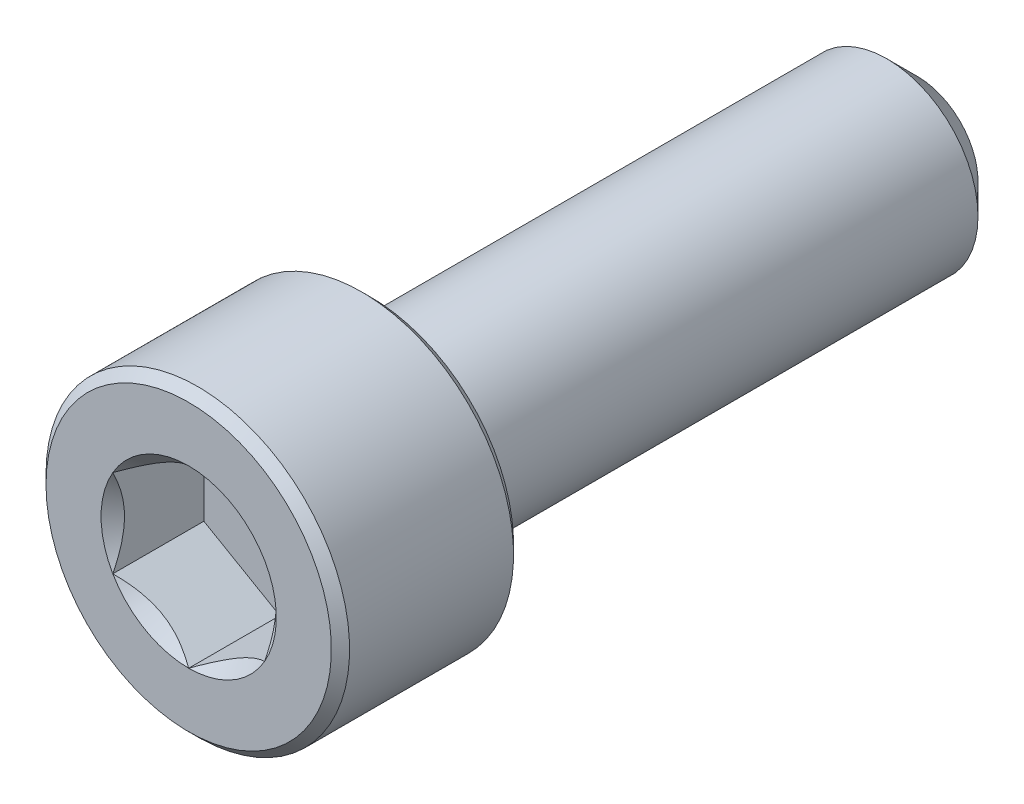
ISO-10303-21;
HEADER;
FILE_DESCRIPTION(('STEP AP214'),'2;1');
FILE_NAME('part.step','',(''),(''),'','','');
FILE_SCHEMA(('AUTOMOTIVE_DESIGN { 1 0 10303 214 1 1 1 1 }'));
ENDSEC;
DATA;
#1=APPLICATION_CONTEXT('core data for automotive mechanical design processes');
#2=APPLICATION_PROTOCOL_DEFINITION('international standard','automotive_design',2000,#1);
#3=PRODUCT_CONTEXT('',#1,'mechanical');
#4=PRODUCT('Part','Part','',(#3));
#5=PRODUCT_RELATED_PRODUCT_CATEGORY('part','',(#4));
#6=PRODUCT_DEFINITION_FORMATION('','',#4);
#7=PRODUCT_DEFINITION_CONTEXT('part definition',#1,'design');
#8=PRODUCT_DEFINITION('design','',#6,#7);
#9=PRODUCT_DEFINITION_SHAPE('','',#8);
#10=(LENGTH_UNIT() NAMED_UNIT(*) SI_UNIT(.MILLI.,.METRE.));
#11=(NAMED_UNIT(*) PLANE_ANGLE_UNIT() SI_UNIT($,.RADIAN.));
#12=(NAMED_UNIT(*) SI_UNIT($,.STERADIAN.) SOLID_ANGLE_UNIT());
#13=UNCERTAINTY_MEASURE_WITH_UNIT(LENGTH_MEASURE(1.E-05),#10,'distance_accuracy_value','');
#14=(GEOMETRIC_REPRESENTATION_CONTEXT(3) GLOBAL_UNCERTAINTY_ASSIGNED_CONTEXT((#13)) GLOBAL_UNIT_ASSIGNED_CONTEXT((#10,
#11,#12)) REPRESENTATION_CONTEXT('',''));
#15=CARTESIAN_POINT('',(0.,0.,0.));
#16=DIRECTION('',(0.,0.,1.));
#17=DIRECTION('',(1.,0.,0.));
#18=AXIS2_PLACEMENT_3D('',#15,#16,#17);
#19=CARTESIAN_POINT('',(0.,4.7,12.));
#20=DIRECTION('',(0.,0.,1.));
#21=DIRECTION('',(1.,0.,0.));
#22=AXIS2_PLACEMENT_3D('',#19,#20,#21);
#23=PLANE('',#22);
#24=CARTESIAN_POINT('',(0.,0.,12.));
#25=DIRECTION('',(0.,0.,1.));
#26=DIRECTION('',(1.,0.,0.));
#27=AXIS2_PLACEMENT_3D('',#24,#25,#26);
#28=CIRCLE('',#27,2.88675134594813);
#29=CARTESIAN_POINT('',(2.5,1.44337567297407,12.));
#30=VERTEX_POINT('',#29);
#31=CARTESIAN_POINT('',(0.,2.88675134594813,12.));
#32=VERTEX_POINT('',#31);
#33=EDGE_CURVE('E92',#30,#32,#28,.T.);
#34=ORIENTED_EDGE('',*,*,#33,.F.);
#35=CARTESIAN_POINT('',(2.5,-1.44337567297407,12.));
#36=VERTEX_POINT('',#35);
#37=EDGE_CURVE('E52',#36,#30,#28,.T.);
#38=ORIENTED_EDGE('',*,*,#37,.F.);
#39=CARTESIAN_POINT('',(0.,-2.88675134594813,12.));
#40=VERTEX_POINT('',#39);
#41=EDGE_CURVE('E278',#40,#36,#28,.T.);
#42=ORIENTED_EDGE('',*,*,#41,.F.);
#43=CARTESIAN_POINT('',(-2.5,-1.44337567297406,12.));
#44=VERTEX_POINT('',#43);
#45=EDGE_CURVE('E59',#44,#40,#28,.T.);
#46=ORIENTED_EDGE('',*,*,#45,.F.);
#47=CARTESIAN_POINT('',(-2.5,1.44337567297407,12.));
#48=VERTEX_POINT('',#47);
#49=EDGE_CURVE('E128',#48,#44,#28,.T.);
#50=ORIENTED_EDGE('',*,*,#49,.F.);
#51=EDGE_CURVE('E101',#32,#48,#28,.T.);
#52=ORIENTED_EDGE('',*,*,#51,.F.);
#53=EDGE_LOOP('',(#34,#38,#42,#46,#50,#52));
#54=FACE_BOUND('',#53,.T.);
#55=CARTESIAN_POINT('',(0.,0.,12.));
#56=DIRECTION('',(0.,0.,-1.));
#57=DIRECTION('',(-1.,0.,0.));
#58=AXIS2_PLACEMENT_3D('',#55,#56,#57);
#59=CIRCLE('',#58,4.7);
#60=CARTESIAN_POINT('',(-4.7,0.,12.));
#61=VERTEX_POINT('',#60);
#62=EDGE_CURVE('E46',#61,#61,#59,.T.);
#63=ORIENTED_EDGE('',*,*,#62,.F.);
#64=EDGE_LOOP('',(#63));
#65=FACE_BOUND('',#64,.T.);
#66=ADVANCED_FACE('F33',(#54,#65),#23,.T.);
#67=CARTESIAN_POINT('',(0.,0.,11.7));
#68=DIRECTION('',(0.,0.,-1.));
#69=DIRECTION('',(-1.,0.,0.));
#70=AXIS2_PLACEMENT_3D('',#67,#68,#69);
#71=CONICAL_SURFACE('',#70,5.,0.785398163397451);
#72=ORIENTED_EDGE('',*,*,#62,.T.);
#73=EDGE_LOOP('',(#72));
#74=FACE_BOUND('',#73,.T.);
#75=CARTESIAN_POINT('',(0.,0.,11.7));
#76=DIRECTION('',(0.,0.,-1.));
#77=DIRECTION('',(-1.,0.,0.));
#78=AXIS2_PLACEMENT_3D('',#75,#76,#77);
#79=CIRCLE('',#78,5.);
#80=CARTESIAN_POINT('',(-5.,0.,11.7));
#81=VERTEX_POINT('',#80);
#82=EDGE_CURVE('E212',#81,#81,#79,.T.);
#83=ORIENTED_EDGE('',*,*,#82,.F.);
#84=EDGE_LOOP('',(#83));
#85=FACE_BOUND('',#84,.T.);
#86=ADVANCED_FACE('F217',(#74,#85),#71,.T.);
#87=CARTESIAN_POINT('',(0.,0.,-12.));
#88=DIRECTION('',(0.,0.,-1.));
#89=DIRECTION('',(-1.,0.,0.));
#90=AXIS2_PLACEMENT_3D('',#87,#88,#89);
#91=CYLINDRICAL_SURFACE('',#90,5.);
#92=ORIENTED_EDGE('',*,*,#82,.T.);
#93=EDGE_LOOP('',(#92));
#94=FACE_BOUND('',#93,.T.);
#95=CARTESIAN_POINT('',(0.,0.,6.3));
#96=DIRECTION('',(0.,0.,-1.));
#97=DIRECTION('',(-1.,0.,0.));
#98=AXIS2_PLACEMENT_3D('',#95,#96,#97);
#99=CIRCLE('',#98,5.);
#100=CARTESIAN_POINT('',(-5.,0.,6.3));
#101=VERTEX_POINT('',#100);
#102=EDGE_CURVE('E209',#101,#101,#99,.T.);
#103=ORIENTED_EDGE('',*,*,#102,.F.);
#104=EDGE_LOOP('',(#103));
#105=FACE_BOUND('',#104,.T.);
#106=ADVANCED_FACE('F223',(#94,#105),#91,.T.);
#107=CARTESIAN_POINT('',(0.,0.,6.));
#108=DIRECTION('',(0.,0.,1.));
#109=DIRECTION('',(1.,0.,0.));
#110=AXIS2_PLACEMENT_3D('',#107,#108,#109);
#111=CONICAL_SURFACE('',#110,4.7,0.785398163397453);
#112=ORIENTED_EDGE('',*,*,#102,.T.);
#113=EDGE_LOOP('',(#112));
#114=FACE_BOUND('',#113,.T.);
#115=CARTESIAN_POINT('',(0.,0.,6.));
#116=DIRECTION('',(0.,0.,-1.));
#117=DIRECTION('',(-1.,0.,0.));
#118=AXIS2_PLACEMENT_3D('',#115,#116,#117);
#119=CIRCLE('',#118,4.7);
#120=CARTESIAN_POINT('',(-4.7,0.,6.));
#121=VERTEX_POINT('',#120);
#122=EDGE_CURVE('E206',#121,#121,#119,.T.);
#123=ORIENTED_EDGE('',*,*,#122,.F.);
#124=EDGE_LOOP('',(#123));
#125=FACE_BOUND('',#124,.T.);
#126=ADVANCED_FACE('F227',(#114,#125),#111,.T.);
#127=CARTESIAN_POINT('',(0.,4.7,6.));
#128=DIRECTION('',(0.,0.,-1.));
#129=DIRECTION('',(-1.,0.,0.));
#130=AXIS2_PLACEMENT_3D('',#127,#128,#129);
#131=PLANE('',#130);
#132=ORIENTED_EDGE('',*,*,#122,.T.);
#133=EDGE_LOOP('',(#132));
#134=FACE_BOUND('',#133,.T.);
#135=CARTESIAN_POINT('',(0.,0.,6.));
#136=DIRECTION('',(0.,0.,-1.));
#137=DIRECTION('',(-1.,0.,0.));
#138=AXIS2_PLACEMENT_3D('',#135,#136,#137);
#139=CIRCLE('',#138,3.);
#140=CARTESIAN_POINT('',(-3.,0.,6.));
#141=VERTEX_POINT('',#140);
#142=EDGE_CURVE('E203',#141,#141,#139,.T.);
#143=ORIENTED_EDGE('',*,*,#142,.F.);
#144=EDGE_LOOP('',(#143));
#145=FACE_BOUND('',#144,.T.);
#146=ADVANCED_FACE('F233',(#134,#145),#131,.T.);
#147=CARTESIAN_POINT('',(0.,0.,-12.));
#148=DIRECTION('',(0.,0.,-1.));
#149=DIRECTION('',(-1.,0.,0.));
#150=AXIS2_PLACEMENT_3D('',#147,#148,#149);
#151=CYLINDRICAL_SURFACE('',#150,3.);
#152=ORIENTED_EDGE('',*,*,#142,.T.);
#153=EDGE_LOOP('',(#152));
#154=FACE_BOUND('',#153,.T.);
#155=CARTESIAN_POINT('',(0.,0.,-11.));
#156=DIRECTION('',(0.,0.,-1.));
#157=DIRECTION('',(-1.,0.,0.));
#158=AXIS2_PLACEMENT_3D('',#155,#156,#157);
#159=CIRCLE('',#158,3.);
#160=CARTESIAN_POINT('',(-3.,0.,-11.));
#161=VERTEX_POINT('',#160);
#162=EDGE_CURVE('E200',#161,#161,#159,.T.);
#163=ORIENTED_EDGE('',*,*,#162,.F.);
#164=EDGE_LOOP('',(#163));
#165=FACE_BOUND('',#164,.T.);
#166=ADVANCED_FACE('F237',(#154,#165),#151,.T.);
#167=CARTESIAN_POINT('',(0.,0.,-12.));
#168=DIRECTION('',(0.,0.,1.));
#169=DIRECTION('',(1.,0.,0.));
#170=AXIS2_PLACEMENT_3D('',#167,#168,#169);
#171=CONICAL_SURFACE('',#170,2.,0.785398163397444);
#172=ORIENTED_EDGE('',*,*,#162,.T.);
#173=EDGE_LOOP('',(#172));
#174=FACE_BOUND('',#173,.T.);
#175=CARTESIAN_POINT('',(0.,0.,-12.));
#176=DIRECTION('',(0.,0.,-1.));
#177=DIRECTION('',(-1.,0.,0.));
#178=AXIS2_PLACEMENT_3D('',#175,#176,#177);
#179=CIRCLE('',#178,2.);
#180=CARTESIAN_POINT('',(-2.,0.,-12.));
#181=VERTEX_POINT('',#180);
#182=EDGE_CURVE('E188',#181,#181,#179,.T.);
#183=ORIENTED_EDGE('',*,*,#182,.F.);
#184=EDGE_LOOP('',(#183));
#185=FACE_BOUND('',#184,.T.);
#186=ADVANCED_FACE('F240',(#174,#185),#171,.T.);
#187=CARTESIAN_POINT('',(0.,2.,-12.));
#188=DIRECTION('',(0.,0.,-1.));
#189=DIRECTION('',(-1.,0.,0.));
#190=AXIS2_PLACEMENT_3D('',#187,#188,#189);
#191=PLANE('',#190);
#192=ORIENTED_EDGE('',*,*,#182,.T.);
#193=EDGE_LOOP('',(#192));
#194=FACE_BOUND('',#193,.T.);
#195=ADVANCED_FACE('F161',(#194),#191,.T.);
#196=CARTESIAN_POINT('',(0.,0.,12.));
#197=DIRECTION('',(0.,0.,1.));
#198=DIRECTION('',(1.,0.,0.));
#199=AXIS2_PLACEMENT_3D('',#196,#197,#198);
#200=CONICAL_SURFACE('',#199,2.88675134594813,0.78539816339745);
#201=ORIENTED_EDGE('',*,*,#51,.T.);
#202=CARTESIAN_POINT('',(0.00020000000000054,2.88686681600197,12.0001154769818));
#203=CARTESIAN_POINT('',(-0.0857382777877643,2.83725032818751,11.9505407053547));
#204=CARTESIAN_POINT('',(-0.173113567275753,2.7868041812811,11.9038774813625));
#205=CARTESIAN_POINT('',(-0.351281456165588,2.6839389026696,11.8184381400383));
#206=CARTESIAN_POINT('',(-0.442091000681074,2.6315099876986,11.779709562406));
#207=CARTESIAN_POINT('',(-0.625204123126921,2.52578957716234,11.7133667038977));
#208=CARTESIAN_POINT('',(-0.71746106452934,2.47252500720904,11.6855856685309));
#209=CARTESIAN_POINT('',(-0.904006008776286,2.3648232334321,11.6427831759107));
#210=CARTESIAN_POINT('',(-0.998288312566283,2.31038931995913,11.6277297666713));
#211=CARTESIAN_POINT('',(-1.16077825829185,2.21657570605387,11.6141477222095));
#212=CARTESIAN_POINT('',(-1.22877596788015,2.17731721011878,11.6121370992408));
#213=CARTESIAN_POINT('',(-1.36466024116922,2.0988643883567,11.6155241171875));
#214=CARTESIAN_POINT('',(-1.43254675755224,2.05967008984862,11.6209243552998));
#215=CARTESIAN_POINT('',(-1.56767878823611,1.98165157555715,11.6388257884025));
#216=CARTESIAN_POINT('',(-1.63492349975356,1.94282782326097,11.6513349270465));
#217=CARTESIAN_POINT('',(-1.7682501008182,1.86585167424616,11.6827675019557));
#218=CARTESIAN_POINT('',(-1.83433207909966,1.82769922629678,11.7016904464968));
#219=CARTESIAN_POINT('',(-2.00359634669126,1.72997445583858,11.7578673614082));
#220=CARTESIAN_POINT('',(-2.10572912222289,1.67100807039231,11.7993558315962));
#221=CARTESIAN_POINT('',(-2.25590641494051,1.58430317001562,11.8693940467231));
#222=CARTESIAN_POINT('',(-2.30539653988261,1.55573003305807,11.8940022521161));
#223=CARTESIAN_POINT('',(-2.40346006383885,1.49911303110426,11.9454618867152));
#224=CARTESIAN_POINT('',(-2.45203400349693,1.47106885396706,11.9723119387794));
#225=CARTESIAN_POINT('',(-2.5002,1.44326020292023,12.0001154769818));
#226=B_SPLINE_CURVE_WITH_KNOTS('',3,(#202,#203,#204,#205,#206,#207,#208,#209,#210,#211,#212,
#213,#214,#215,#216,#217,#218,#219,#220,#221,#222,#223,#224,#225),.UNSPECIFIED.,.F.,.F.,(4,2,2,
2,2,2,2,2,2,2,2,4),(0.,0.333012085133924,0.667964518301397,0.997597032043299,1.32639954393844,
1.56169424147169,1.79707142102083,2.03271213522171,2.26833478775651,2.64260240809533,
2.82922877818864,3.01574133749025),.UNSPECIFIED.);
#227=EDGE_CURVE('E11',#32,#48,#226,.T.);
#228=ORIENTED_EDGE('',*,*,#227,.F.);
#229=EDGE_LOOP('',(#201,#228));
#230=FACE_BOUND('',#229,.T.);
#231=ADVANCED_FACE('F105',(#230),#200,.F.);
#232=ORIENTED_EDGE('',*,*,#49,.T.);
#233=CARTESIAN_POINT('',(-2.5,-2.96668433955212,12.9928383192799));
#234=CARTESIAN_POINT('',(-2.5,-2.89483170967249,12.9379057089797));
#235=CARTESIAN_POINT('',(-2.5,-2.82258679707705,12.883478050823));
#236=CARTESIAN_POINT('',(-2.5,-2.67715393829105,12.7758617915343));
#237=CARTESIAN_POINT('',(-2.5,-2.60396576868743,12.7226734926472));
#238=CARTESIAN_POINT('',(-2.5,-2.45595268046653,12.6173865397426));
#239=CARTESIAN_POINT('',(-2.5,-2.38111948346966,12.5652994850005));
#240=CARTESIAN_POINT('',(-2.5,-2.23019896534479,12.4629812536341));
#241=CARTESIAN_POINT('',(-2.5,-2.15411173180743,12.4127499481792));
#242=CARTESIAN_POINT('',(-2.5,-1.99575761371829,12.311547152196));
#243=CARTESIAN_POINT('',(-2.5,-1.91339821044007,12.2607196975498));
#244=CARTESIAN_POINT('',(-2.5,-1.74677292530007,12.1622970160088));
#245=CARTESIAN_POINT('',(-2.5,-1.6625072948511,12.1147013661458));
#246=CARTESIAN_POINT('',(-2.5,-1.49202090628761,12.0237370895292));
#247=CARTESIAN_POINT('',(-2.5,-1.4058065139511,11.9803566253319));
#248=CARTESIAN_POINT('',(-2.5,-1.23096887512707,11.8988023964179));
#249=CARTESIAN_POINT('',(-2.5,-1.14234677306193,11.8606262082116));
#250=CARTESIAN_POINT('',(-2.5,-0.970857842618474,11.7940912240297));
#251=CARTESIAN_POINT('',(-2.5,-0.88821917035142,11.7651503854592));
#252=CARTESIAN_POINT('',(-2.5,-0.720875298126569,11.7138877367376));
#253=CARTESIAN_POINT('',(-2.5,-0.636169963529764,11.6915663590842));
#254=CARTESIAN_POINT('',(-2.5,-0.466650942448522,11.6551078210399));
#255=CARTESIAN_POINT('',(-2.5,-0.381869134653474,11.640824902214));
#256=CARTESIAN_POINT('',(-2.5,-0.21130174226405,11.6207346384147));
#257=CARTESIAN_POINT('',(-2.5,-0.125516356521813,11.6149256421311));
#258=CARTESIAN_POINT('',(-2.5,0.0426703656744087,11.6122567453414));
#259=CARTESIAN_POINT('',(-2.5,0.125066107632579,11.6150393831091));
#260=CARTESIAN_POINT('',(-2.5,0.289193381610074,11.6285896677016));
#261=CARTESIAN_POINT('',(-2.5,0.370924851074764,11.6393580579361));
#262=CARTESIAN_POINT('',(-2.5,0.534518605306861,11.668460488394));
#263=CARTESIAN_POINT('',(-2.5,0.616357066153054,11.6869264467587));
#264=CARTESIAN_POINT('',(-2.5,0.778230408567296,11.7304160931401));
#265=CARTESIAN_POINT('',(-2.5,0.85826540901519,11.7554393475341));
#266=CARTESIAN_POINT('',(-2.5,1.1064014205137,11.8425323271403));
#267=CARTESIAN_POINT('',(-2.5,1.27108970475709,11.9143583169891));
#268=CARTESIAN_POINT('',(-2.5,1.51211013995078,12.0341428940312));
#269=CARTESIAN_POINT('',(-2.5,1.59159684007468,12.0761721404265));
#270=CARTESIAN_POINT('',(-2.5,1.74876895904321,12.1634810506814));
#271=CARTESIAN_POINT('',(-2.5,1.82645469386738,12.2087601385578));
#272=CARTESIAN_POINT('',(-2.5,1.97643122124165,12.2996104452916));
#273=CARTESIAN_POINT('',(-2.5,2.04879877304287,12.3450563815238));
#274=CARTESIAN_POINT('',(-2.5,2.19229239644038,12.4378770245958));
#275=CARTESIAN_POINT('',(-2.5,2.2634183740633,12.4852518765365));
#276=CARTESIAN_POINT('',(-2.5,2.4040160675888,12.5811974908952));
#277=CARTESIAN_POINT('',(-2.5,2.473496495387,12.6297555399303));
#278=CARTESIAN_POINT('',(-2.5,2.61150521882323,12.7281681623755));
#279=CARTESIAN_POINT('',(-2.5,2.68003377150943,12.7780223748942));
#280=CARTESIAN_POINT('',(-2.5,2.74816343524431,12.8284070984273));
#281=B_SPLINE_CURVE_WITH_KNOTS('',3,(#233,#234,#235,#236,#237,#238,#239,#240,#241,#242,#243,
#244,#245,#246,#247,#248,#249,#250,#251,#252,#253,#254,#255,#256,#257,#258,#259,#260,#261,#262,
#263,#264,#265,#266,#267,#268,#269,#270,#271,#272,#273,#274,#275,#276,#277,#278,#279,#280),
.UNSPECIFIED.,.F.,.F.,(4,2,2,2,2,2,2,2,2,2,2,2,2,2,2,2,2,2,2,2,2,2,2,4),(0.,0.271341667855833,
0.542748830046722,0.816253709161615,1.08973956507594,1.38002315639178,1.67026868280412,
1.959674013636,2.24894411253435,2.51139576932094,2.77386457021756,3.0314066607157,
3.28889855737335,3.53582375183444,3.78277193594475,4.03413854269895,4.28548853120069,
4.82282938730674,5.09254998785807,5.36222290216636,5.61855395261544,5.87490432107987,
6.12918893681204,6.38340349453406),.UNSPECIFIED.);
#282=EDGE_CURVE('E100',#48,#44,#281,.F.);
#283=ORIENTED_EDGE('',*,*,#282,.F.);
#284=EDGE_LOOP('',(#232,#283));
#285=FACE_BOUND('',#284,.T.);
#286=ADVANCED_FACE('F255',(#285),#200,.F.);
#287=ORIENTED_EDGE('',*,*,#45,.T.);
#288=CARTESIAN_POINT('',(-2.5002,-1.44326020292023,12.0001154769818));
#289=CARTESIAN_POINT('',(-2.41426172221224,-1.49287669073469,11.9505407053547));
#290=CARTESIAN_POINT('',(-2.32688643272425,-1.5433228376411,11.9038774813625));
#291=CARTESIAN_POINT('',(-2.14871854383441,-1.64618811625259,11.8184381400383));
#292=CARTESIAN_POINT('',(-2.05790899931893,-1.69861703122359,11.779709562406));
#293=CARTESIAN_POINT('',(-1.87479587687308,-1.80433744175986,11.7133667038977));
#294=CARTESIAN_POINT('',(-1.78253893547066,-1.85760201171315,11.6855856685309));
#295=CARTESIAN_POINT('',(-1.59599399122372,-1.96530378549009,11.6427831759107));
#296=CARTESIAN_POINT('',(-1.50171168743372,-2.01973769896306,11.6277297666713));
#297=CARTESIAN_POINT('',(-1.33922174170816,-2.11355131286833,11.6141477222095));
#298=CARTESIAN_POINT('',(-1.27122403211985,-2.15280980880341,11.6121370992408));
#299=CARTESIAN_POINT('',(-1.13533975883078,-2.23126263056549,11.6155241171875));
#300=CARTESIAN_POINT('',(-1.06745324244776,-2.27045692907357,11.6209243552998));
#301=CARTESIAN_POINT('',(-0.932321211763896,-2.34847544336505,11.6388257884025));
#302=CARTESIAN_POINT('',(-0.865076500246441,-2.38729919566123,11.6513349270465));
#303=CARTESIAN_POINT('',(-0.731749899181803,-2.46427534467603,11.6827675019557));
#304=CARTESIAN_POINT('',(-0.665667920900345,-2.50242779262542,11.7016904464968));
#305=CARTESIAN_POINT('',(-0.496403653308737,-2.60015256308362,11.7578673614082));
#306=CARTESIAN_POINT('',(-0.394270877777109,-2.65911894852989,11.7993558315962));
#307=CARTESIAN_POINT('',(-0.244093585059492,-2.74582384890657,11.8693940467231));
#308=CARTESIAN_POINT('',(-0.194603460117392,-2.77439698586412,11.8940022521161));
#309=CARTESIAN_POINT('',(-0.096539936161154,-2.83101398781794,11.9454618867152));
#310=CARTESIAN_POINT('',(-0.0479659965030727,-2.85905816495513,11.9723119387794));
#311=CARTESIAN_POINT('',(0.000199999999999383,-2.88686681600197,12.0001154769818));
#312=B_SPLINE_CURVE_WITH_KNOTS('',3,(#288,#289,#290,#291,#292,#293,#294,#295,#296,#297,#298,
#299,#300,#301,#302,#303,#304,#305,#306,#307,#308,#309,#310,#311),.UNSPECIFIED.,.F.,.F.,(4,2,2,
2,2,2,2,2,2,2,2,4),(0.,0.333012085133924,0.667964518301397,0.997597032043299,1.32639954393844,
1.56169424147169,1.79707142102083,2.03271213522171,2.26833478775651,2.64260240809533,
2.82922877818864,3.01574133749025),.UNSPECIFIED.);
#313=EDGE_CURVE('E137',#44,#40,#312,.T.);
#314=ORIENTED_EDGE('',*,*,#313,.F.);
#315=EDGE_LOOP('',(#287,#314));
#316=FACE_BOUND('',#315,.T.);
#317=ADVANCED_FACE('F259',(#316),#200,.F.);
#318=ORIENTED_EDGE('',*,*,#41,.T.);
#319=CARTESIAN_POINT('',(-0.000200000000000439,-2.88686681600197,12.0001154769818));
#320=CARTESIAN_POINT('',(0.0857382777877646,-2.83725032818751,11.9505407053547));
#321=CARTESIAN_POINT('',(0.173113567275753,-2.7868041812811,11.9038774813625));
#322=CARTESIAN_POINT('',(0.351281456165588,-2.6839389026696,11.8184381400383));
#323=CARTESIAN_POINT('',(0.442091000681074,-2.6315099876986,11.779709562406));
#324=CARTESIAN_POINT('',(0.62520412312692,-2.52578957716234,11.7133667038977));
#325=CARTESIAN_POINT('',(0.717461064529339,-2.47252500720904,11.6855856685309));
#326=CARTESIAN_POINT('',(0.904006008776284,-2.3648232334321,11.6427831759107));
#327=CARTESIAN_POINT('',(0.998288312566282,-2.31038931995913,11.6277297666713));
#328=CARTESIAN_POINT('',(1.16077825829184,-2.21657570605387,11.6141477222095));
#329=CARTESIAN_POINT('',(1.22877596788015,-2.17731721011878,11.6121370992408));
#330=CARTESIAN_POINT('',(1.36466024116922,-2.0988643883567,11.6155241171875));
#331=CARTESIAN_POINT('',(1.43254675755224,-2.05967008984862,11.6209243552998));
#332=CARTESIAN_POINT('',(1.5676787882361,-1.98165157555715,11.6388257884025));
#333=CARTESIAN_POINT('',(1.63492349975356,-1.94282782326097,11.6513349270465));
#334=CARTESIAN_POINT('',(1.7682501008182,-1.86585167424616,11.6827675019557));
#335=CARTESIAN_POINT('',(1.83433207909966,-1.82769922629678,11.7016904464968));
#336=CARTESIAN_POINT('',(2.00359634669126,-1.72997445583858,11.7578673614082));
#337=CARTESIAN_POINT('',(2.10572912222289,-1.67100807039231,11.7993558315962));
#338=CARTESIAN_POINT('',(2.25590641494051,-1.58430317001562,11.8693940467231));
#339=CARTESIAN_POINT('',(2.30539653988261,-1.55573003305807,11.8940022521161));
#340=CARTESIAN_POINT('',(2.40346006383885,-1.49911303110426,11.9454618867152));
#341=CARTESIAN_POINT('',(2.45203400349693,-1.47106885396706,11.9723119387794));
#342=CARTESIAN_POINT('',(2.5002,-1.44326020292023,12.0001154769818));
#343=B_SPLINE_CURVE_WITH_KNOTS('',3,(#319,#320,#321,#322,#323,#324,#325,#326,#327,#328,#329,
#330,#331,#332,#333,#334,#335,#336,#337,#338,#339,#340,#341,#342),.UNSPECIFIED.,.F.,.F.,(4,2,2,
2,2,2,2,2,2,2,2,4),(0.,0.333012085133923,0.667964518301395,0.997597032043296,1.32639954393844,
1.56169424147168,1.79707142102083,2.0327121352217,2.2683347877565,2.64260240809533,
2.82922877818864,3.01574133749025),.UNSPECIFIED.);
#344=EDGE_CURVE('E280',#40,#36,#343,.T.);
#345=ORIENTED_EDGE('',*,*,#344,.F.);
#346=EDGE_LOOP('',(#318,#345));
#347=FACE_BOUND('',#346,.T.);
#348=ADVANCED_FACE('F268',(#347),#200,.F.);
#349=ORIENTED_EDGE('',*,*,#37,.T.);
#350=CARTESIAN_POINT('',(2.5,-2.96668433956992,12.9928383192935));
#351=CARTESIAN_POINT('',(2.5,-2.89483170968978,12.9379057089928));
#352=CARTESIAN_POINT('',(2.5,-2.82258679709383,12.8834780508356));
#353=CARTESIAN_POINT('',(2.5,-2.6771539383068,12.7758617915458));
#354=CARTESIAN_POINT('',(2.5,-2.60396576870266,12.7226734926582));
#355=CARTESIAN_POINT('',(2.5,-2.45595268048071,12.6173865397526));
#356=CARTESIAN_POINT('',(2.5,-2.38111948348332,12.5652994850099));
#357=CARTESIAN_POINT('',(2.5,-2.23019896535737,12.4629812536425));
#358=CARTESIAN_POINT('',(2.5,-2.15411173181947,12.4127499481871));
#359=CARTESIAN_POINT('',(2.5,-1.99575761372916,12.3115471522028));
#360=CARTESIAN_POINT('',(2.5,-1.91339821045031,12.260719697556));
#361=CARTESIAN_POINT('',(2.5,-1.74677292530903,12.1622970160139));
#362=CARTESIAN_POINT('',(2.5,-1.6625072948594,12.1147013661504));
#363=CARTESIAN_POINT('',(2.5,-1.49202090629459,12.0237370895328));
#364=CARTESIAN_POINT('',(2.5,-1.4058065139574,11.980356625335));
#365=CARTESIAN_POINT('',(2.5,-1.23096887513198,11.8988023964201));
#366=CARTESIAN_POINT('',(2.5,-1.14234677306614,11.8606262082134));
#367=CARTESIAN_POINT('',(2.5,-0.970857842622378,11.7940912240311));
#368=CARTESIAN_POINT('',(2.5,-0.888219170355766,11.7651503854607));
#369=CARTESIAN_POINT('',(2.5,-0.720875298131817,11.713887736739));
#370=CARTESIAN_POINT('',(2.5,-0.636169963535471,11.6915663590856));
#371=CARTESIAN_POINT('',(2.5,-0.466650942455131,11.6551078210411));
#372=CARTESIAN_POINT('',(2.5,-0.381869134660527,11.6408249022151));
#373=CARTESIAN_POINT('',(2.5,-0.211301742271978,11.6207346384154));
#374=CARTESIAN_POINT('',(2.5,-0.125516356530172,11.6149256421315));
#375=CARTESIAN_POINT('',(2.5,0.0426703656652954,11.6122567453413));
#376=CARTESIAN_POINT('',(2.5,0.125066107623141,11.6150393831087));
#377=CARTESIAN_POINT('',(2.5,0.289193381600021,11.6285896677004));
#378=CARTESIAN_POINT('',(2.5,0.370924851064421,11.6393580579346));
#379=CARTESIAN_POINT('',(2.5,0.534518605295947,11.6684604883917));
#380=CARTESIAN_POINT('',(2.5,0.616357066141858,11.686926446756));
#381=CARTESIAN_POINT('',(2.5,0.778230408555567,11.7304160931367));
#382=CARTESIAN_POINT('',(2.5,0.858265409003208,11.7554393475302));
#383=CARTESIAN_POINT('',(2.5,1.10640142049915,11.8425323271345));
#384=CARTESIAN_POINT('',(2.5,1.27108970474035,11.9143583169815));
#385=CARTESIAN_POINT('',(2.5,1.51211013993089,12.034142894021));
#386=CARTESIAN_POINT('',(2.5,1.59159684005377,12.0761721404153));
#387=CARTESIAN_POINT('',(2.5,1.74876895902027,12.1634810506683));
#388=CARTESIAN_POINT('',(2.5,1.82645469384344,12.2087601385437));
#389=CARTESIAN_POINT('',(2.5,1.97643122121589,12.2996104452756));
#390=CARTESIAN_POINT('',(2.5,2.0487987730163,12.345056381507));
#391=CARTESIAN_POINT('',(2.5,2.19229239641219,12.4378770245772));
#392=CARTESIAN_POINT('',(2.5,2.26341837403431,12.485251876517));
#393=CARTESIAN_POINT('',(2.5,2.40401606755821,12.581197490874));
#394=CARTESIAN_POINT('',(2.5,2.47349649535563,12.6297555399082));
#395=CARTESIAN_POINT('',(2.5,2.61150521879029,12.7281681623517));
#396=CARTESIAN_POINT('',(2.5,2.68003377147571,12.7780223748695));
#397=CARTESIAN_POINT('',(2.5,2.74816343520981,12.8284070984017));
#398=B_SPLINE_CURVE_WITH_KNOTS('',3,(#350,#351,#352,#353,#354,#355,#356,#357,#358,#359,#360,
#361,#362,#363,#364,#365,#366,#367,#368,#369,#370,#371,#372,#373,#374,#375,#376,#377,#378,#379,
#380,#381,#382,#383,#384,#385,#386,#387,#388,#389,#390,#391,#392,#393,#394,#395,#396,#397),
.UNSPECIFIED.,.F.,.F.,(4,2,2,2,2,2,2,2,2,2,2,2,2,2,2,2,2,2,2,2,2,2,2,4),(0.,0.271341667858004,
0.542748830051066,0.81625370916817,1.08973956508471,1.38002315640303,1.67026868281787,
1.95967401365221,2.24894411255303,2.51139576933832,2.77386457023366,3.03140666073056,
3.28889855738698,3.53582375184707,3.78277193595638,4.03413854270949,4.28548853121014,
4.82282938730813,5.0925499878554,5.36222290215963,5.61855395260524,5.87490432106621,
6.12918893679497,6.38340349451356),.UNSPECIFIED.);
#399=EDGE_CURVE('E117',#36,#30,#398,.T.);
#400=ORIENTED_EDGE('',*,*,#399,.F.);
#401=EDGE_LOOP('',(#349,#400));
#402=FACE_BOUND('',#401,.T.);
#403=ADVANCED_FACE('F262',(#402),#200,.F.);
#404=ORIENTED_EDGE('',*,*,#33,.T.);
#405=CARTESIAN_POINT('',(2.5002,1.44326020292023,12.0001154769818));
#406=CARTESIAN_POINT('',(2.41426172221224,1.49287669073469,11.9505407053547));
#407=CARTESIAN_POINT('',(2.32688643272425,1.5433228376411,11.9038774813625));
#408=CARTESIAN_POINT('',(2.14871854383441,1.64618811625259,11.8184381400383));
#409=CARTESIAN_POINT('',(2.05790899931893,1.6986170312236,11.779709562406));
#410=CARTESIAN_POINT('',(1.87479587687308,1.80433744175986,11.7133667038977));
#411=CARTESIAN_POINT('',(1.78253893547066,1.85760201171316,11.6855856685309));
#412=CARTESIAN_POINT('',(1.59599399122372,1.96530378549009,11.6427831759107));
#413=CARTESIAN_POINT('',(1.50171168743372,2.01973769896307,11.6277297666713));
#414=CARTESIAN_POINT('',(1.33922174170816,2.11355131286833,11.6141477222095));
#415=CARTESIAN_POINT('',(1.27122403211985,2.15280980880341,11.6121370992408));
#416=CARTESIAN_POINT('',(1.13533975883078,2.23126263056549,11.6155241171875));
#417=CARTESIAN_POINT('',(1.06745324244776,2.27045692907358,11.6209243552998));
#418=CARTESIAN_POINT('',(0.932321211763896,2.34847544336505,11.6388257884025));
#419=CARTESIAN_POINT('',(0.865076500246441,2.38729919566123,11.6513349270465));
#420=CARTESIAN_POINT('',(0.731749899181802,2.46427534467604,11.6827675019557));
#421=CARTESIAN_POINT('',(0.665667920900344,2.50242779262542,11.7016904464968));
#422=CARTESIAN_POINT('',(0.496403653308737,2.60015256308362,11.7578673614082));
#423=CARTESIAN_POINT('',(0.394270877777109,2.65911894852989,11.7993558315962));
#424=CARTESIAN_POINT('',(0.244093585059493,2.74582384890657,11.8693940467231));
#425=CARTESIAN_POINT('',(0.194603460117392,2.77439698586412,11.8940022521161));
#426=CARTESIAN_POINT('',(0.096539936161154,2.83101398781794,11.9454618867152));
#427=CARTESIAN_POINT('',(0.0479659965030727,2.85905816495513,11.9723119387794));
#428=CARTESIAN_POINT('',(-0.000199999999999507,2.88686681600197,12.0001154769818));
#429=B_SPLINE_CURVE_WITH_KNOTS('',3,(#405,#406,#407,#408,#409,#410,#411,#412,#413,#414,#415,
#416,#417,#418,#419,#420,#421,#422,#423,#424,#425,#426,#427,#428),.UNSPECIFIED.,.F.,.F.,(4,2,2,
2,2,2,2,2,2,2,2,4),(0.,0.333012085133925,0.667964518301398,0.997597032043299,1.32639954393844,
1.56169424147169,1.79707142102083,2.03271213522171,2.26833478775651,2.64260240809533,
2.82922877818864,3.01574133749025),.UNSPECIFIED.);
#430=EDGE_CURVE('E96',#30,#32,#429,.T.);
#431=ORIENTED_EDGE('',*,*,#430,.F.);
#432=EDGE_LOOP('',(#404,#431));
#433=FACE_BOUND('',#432,.T.);
#434=ADVANCED_FACE('F94',(#433),#200,.F.);
#435=CARTESIAN_POINT('',(0.,0.,9.));
#436=DIRECTION('',(0.,0.,1.));
#437=DIRECTION('',(1.,0.,0.));
#438=AXIS2_PLACEMENT_3D('',#435,#436,#437);
#439=PLANE('',#438);
#440=DIRECTION('',(-0.866025403784439,0.5,0.));
#441=VECTOR('',#440,1.);
#442=CARTESIAN_POINT('',(2.5,1.44337567297407,9.));
#443=LINE('',#442,#441);
#444=CARTESIAN_POINT('',(2.5,1.44337567297407,9.));
#445=VERTEX_POINT('',#444);
#446=CARTESIAN_POINT('',(0.,2.88675134594813,9.));
#447=VERTEX_POINT('',#446);
#448=EDGE_CURVE('E116',#445,#447,#443,.T.);
#449=ORIENTED_EDGE('',*,*,#448,.T.);
#450=DIRECTION('',(-0.866025403784439,-0.5,0.));
#451=VECTOR('',#450,1.);
#452=CARTESIAN_POINT('',(0.,2.88675134594813,9.));
#453=LINE('',#452,#451);
#454=CARTESIAN_POINT('',(-2.5,1.44337567297407,9.));
#455=VERTEX_POINT('',#454);
#456=EDGE_CURVE('E121',#447,#455,#453,.T.);
#457=ORIENTED_EDGE('',*,*,#456,.T.);
#458=DIRECTION('',(0.,-1.,0.));
#459=VECTOR('',#458,1.);
#460=CARTESIAN_POINT('',(-2.5,1.44337567297407,9.));
#461=LINE('',#460,#459);
#462=CARTESIAN_POINT('',(-2.5,-1.44337567297406,9.));
#463=VERTEX_POINT('',#462);
#464=EDGE_CURVE('E176',#455,#463,#461,.T.);
#465=ORIENTED_EDGE('',*,*,#464,.T.);
#466=DIRECTION('',(0.866025403784439,-0.5,0.));
#467=VECTOR('',#466,1.);
#468=CARTESIAN_POINT('',(-2.5,-1.44337567297406,9.));
#469=LINE('',#468,#467);
#470=CARTESIAN_POINT('',(0.,-2.88675134594813,9.));
#471=VERTEX_POINT('',#470);
#472=EDGE_CURVE('E179',#463,#471,#469,.T.);
#473=ORIENTED_EDGE('',*,*,#472,.T.);
#474=DIRECTION('',(0.866025403784439,0.5,0.));
#475=VECTOR('',#474,1.);
#476=CARTESIAN_POINT('',(0.,-2.88675134594813,9.));
#477=LINE('',#476,#475);
#478=CARTESIAN_POINT('',(2.5,-1.44337567297407,9.));
#479=VERTEX_POINT('',#478);
#480=EDGE_CURVE('E182',#471,#479,#477,.T.);
#481=ORIENTED_EDGE('',*,*,#480,.T.);
#482=DIRECTION('',(0.,1.,0.));
#483=VECTOR('',#482,1.);
#484=CARTESIAN_POINT('',(2.5,-1.44337567297407,9.));
#485=LINE('',#484,#483);
#486=EDGE_CURVE('E124',#479,#445,#485,.T.);
#487=ORIENTED_EDGE('',*,*,#486,.T.);
#488=EDGE_LOOP('',(#449,#457,#465,#473,#481,#487));
#489=FACE_BOUND('',#488,.T.);
#490=ADVANCED_FACE('F156',(#489),#439,.T.);
#491=CARTESIAN_POINT('',(0.,2.88675134594813,9.));
#492=DIRECTION('',(-0.5,0.866025403784439,0.));
#493=DIRECTION('',(-0.866025403784439,-0.5,0.));
#494=AXIS2_PLACEMENT_3D('',#491,#492,#493);
#495=PLANE('',#494);
#496=DIRECTION('',(0.,0.,1.));
#497=VECTOR('',#496,1.);
#498=CARTESIAN_POINT('',(0.,2.88675134594813,9.));
#499=LINE('',#498,#497);
#500=EDGE_CURVE('E113',#447,#32,#499,.T.);
#501=ORIENTED_EDGE('',*,*,#500,.T.);
#502=ORIENTED_EDGE('',*,*,#227,.T.);
#503=DIRECTION('',(0.,0.,1.));
#504=VECTOR('',#503,1.);
#505=CARTESIAN_POINT('',(-2.5,1.44337567297407,9.));
#506=LINE('',#505,#504);
#507=EDGE_CURVE('E123',#455,#48,#506,.T.);
#508=ORIENTED_EDGE('',*,*,#507,.F.);
#509=ORIENTED_EDGE('',*,*,#456,.F.);
#510=EDGE_LOOP('',(#501,#502,#508,#509));
#511=FACE_BOUND('',#510,.T.);
#512=ADVANCED_FACE('F119',(#511),#495,.F.);
#513=CARTESIAN_POINT('',(-2.5,1.44337567297407,9.));
#514=DIRECTION('',(-1.,0.,0.));
#515=DIRECTION('',(0.,0.,1.));
#516=AXIS2_PLACEMENT_3D('',#513,#514,#515);
#517=PLANE('',#516);
#518=ORIENTED_EDGE('',*,*,#507,.T.);
#519=ORIENTED_EDGE('',*,*,#282,.T.);
#520=DIRECTION('',(0.,0.,1.));
#521=VECTOR('',#520,1.);
#522=CARTESIAN_POINT('',(-2.5,-1.44337567297406,9.));
#523=LINE('',#522,#521);
#524=EDGE_CURVE('E194',#463,#44,#523,.T.);
#525=ORIENTED_EDGE('',*,*,#524,.F.);
#526=ORIENTED_EDGE('',*,*,#464,.F.);
#527=EDGE_LOOP('',(#518,#519,#525,#526));
#528=FACE_BOUND('',#527,.T.);
#529=ADVANCED_FACE('F146',(#528),#517,.F.);
#530=CARTESIAN_POINT('',(-2.5,-1.44337567297406,9.));
#531=DIRECTION('',(-0.5,-0.866025403784439,0.));
#532=DIRECTION('',(0.866025403784439,-0.5,0.));
#533=AXIS2_PLACEMENT_3D('',#530,#531,#532);
#534=PLANE('',#533);
#535=ORIENTED_EDGE('',*,*,#524,.T.);
#536=ORIENTED_EDGE('',*,*,#313,.T.);
#537=DIRECTION('',(0.,0.,1.));
#538=VECTOR('',#537,1.);
#539=CARTESIAN_POINT('',(0.,-2.88675134594813,9.));
#540=LINE('',#539,#538);
#541=EDGE_CURVE('E191',#471,#40,#540,.T.);
#542=ORIENTED_EDGE('',*,*,#541,.F.);
#543=ORIENTED_EDGE('',*,*,#472,.F.);
#544=EDGE_LOOP('',(#535,#536,#542,#543));
#545=FACE_BOUND('',#544,.T.);
#546=ADVANCED_FACE('F149',(#545),#534,.F.);
#547=CARTESIAN_POINT('',(0.,-2.88675134594813,9.));
#548=DIRECTION('',(0.5,-0.866025403784439,0.));
#549=DIRECTION('',(0.866025403784439,0.5,0.));
#550=AXIS2_PLACEMENT_3D('',#547,#548,#549);
#551=PLANE('',#550);
#552=ORIENTED_EDGE('',*,*,#541,.T.);
#553=ORIENTED_EDGE('',*,*,#344,.T.);
#554=DIRECTION('',(0.,0.,1.));
#555=VECTOR('',#554,1.);
#556=CARTESIAN_POINT('',(2.5,-1.44337567297407,9.));
#557=LINE('',#556,#555);
#558=EDGE_CURVE('E189',#479,#36,#557,.T.);
#559=ORIENTED_EDGE('',*,*,#558,.F.);
#560=ORIENTED_EDGE('',*,*,#480,.F.);
#561=EDGE_LOOP('',(#552,#553,#559,#560));
#562=FACE_BOUND('',#561,.T.);
#563=ADVANCED_FACE('F286',(#562),#551,.F.);
#564=CARTESIAN_POINT('',(2.5,-1.44337567297407,9.));
#565=DIRECTION('',(1.,0.,0.));
#566=DIRECTION('',(0.,1.,0.));
#567=AXIS2_PLACEMENT_3D('',#564,#565,#566);
#568=PLANE('',#567);
#569=ORIENTED_EDGE('',*,*,#558,.T.);
#570=ORIENTED_EDGE('',*,*,#399,.T.);
#571=DIRECTION('',(0.,0.,1.));
#572=VECTOR('',#571,1.);
#573=CARTESIAN_POINT('',(2.5,1.44337567297407,9.));
#574=LINE('',#573,#572);
#575=EDGE_CURVE('E115',#445,#30,#574,.T.);
#576=ORIENTED_EDGE('',*,*,#575,.F.);
#577=ORIENTED_EDGE('',*,*,#486,.F.);
#578=EDGE_LOOP('',(#569,#570,#576,#577));
#579=FACE_BOUND('',#578,.T.);
#580=ADVANCED_FACE('F160',(#579),#568,.F.);
#581=CARTESIAN_POINT('',(2.5,1.44337567297407,9.));
#582=DIRECTION('',(0.5,0.866025403784439,0.));
#583=DIRECTION('',(-0.866025403784439,0.5,0.));
#584=AXIS2_PLACEMENT_3D('',#581,#582,#583);
#585=PLANE('',#584);
#586=ORIENTED_EDGE('',*,*,#575,.T.);
#587=ORIENTED_EDGE('',*,*,#430,.T.);
#588=ORIENTED_EDGE('',*,*,#500,.F.);
#589=ORIENTED_EDGE('',*,*,#448,.F.);
#590=EDGE_LOOP('',(#586,#587,#588,#589));
#591=FACE_BOUND('',#590,.T.);
#592=ADVANCED_FACE('F111',(#591),#585,.F.);
#593=CLOSED_SHELL('',(#66,#86,#106,#126,#146,#166,#186,#195,#231,#286,#317,#348,#403,#434,#490,
#512,#529,#546,#563,#580,#592));
#594=MANIFOLD_SOLID_BREP('B2',#593);
#595=ADVANCED_BREP_SHAPE_REPRESENTATION('',(#18,#594),#14);
#596=SHAPE_DEFINITION_REPRESENTATION(#9,#595);
ENDSEC;
END-ISO-10303-21;
